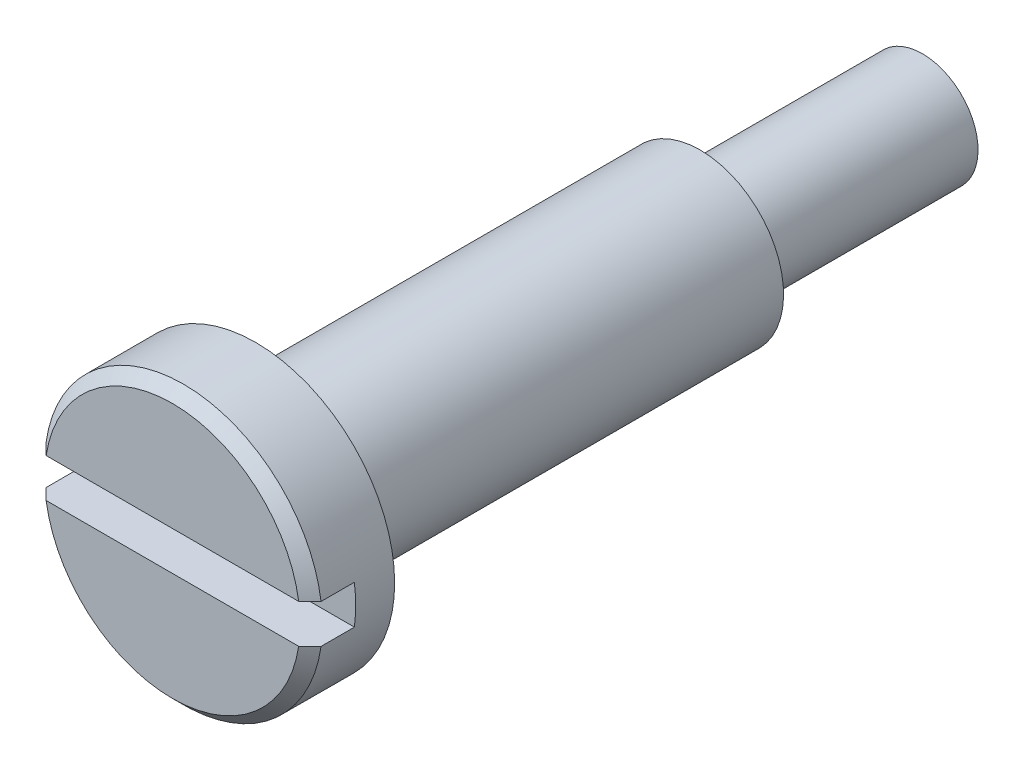
ISO-10303-21;
HEADER;
FILE_DESCRIPTION(('STEP AP214'),'2;1');
FILE_NAME('part.step','',(''),(''),'','','');
FILE_SCHEMA(('AUTOMOTIVE_DESIGN { 1 0 10303 214 1 1 1 1 }'));
ENDSEC;
DATA;
#1=APPLICATION_CONTEXT('core data for automotive mechanical design processes');
#2=APPLICATION_PROTOCOL_DEFINITION('international standard','automotive_design',2000,#1);
#3=PRODUCT_CONTEXT('',#1,'mechanical');
#4=PRODUCT('Part','Part','',(#3));
#5=PRODUCT_RELATED_PRODUCT_CATEGORY('part','',(#4));
#6=PRODUCT_DEFINITION_FORMATION('','',#4);
#7=PRODUCT_DEFINITION_CONTEXT('part definition',#1,'design');
#8=PRODUCT_DEFINITION('design','',#6,#7);
#9=PRODUCT_DEFINITION_SHAPE('','',#8);
#10=(LENGTH_UNIT() NAMED_UNIT(*) SI_UNIT(.MILLI.,.METRE.));
#11=(NAMED_UNIT(*) PLANE_ANGLE_UNIT() SI_UNIT($,.RADIAN.));
#12=(NAMED_UNIT(*) SI_UNIT($,.STERADIAN.) SOLID_ANGLE_UNIT());
#13=UNCERTAINTY_MEASURE_WITH_UNIT(LENGTH_MEASURE(1.E-05),#10,'distance_accuracy_value','');
#14=(GEOMETRIC_REPRESENTATION_CONTEXT(3) GLOBAL_UNCERTAINTY_ASSIGNED_CONTEXT((#13)) GLOBAL_UNIT_ASSIGNED_CONTEXT((#10,
#11,#12)) REPRESENTATION_CONTEXT('',''));
#15=CARTESIAN_POINT('',(0.,0.,0.));
#16=DIRECTION('',(0.,0.,1.));
#17=DIRECTION('',(1.,0.,0.));
#18=AXIS2_PLACEMENT_3D('',#15,#16,#17);
#19=CARTESIAN_POINT('',(0.,0.,0.));
#20=DIRECTION('',(0.,0.,1.));
#21=DIRECTION('',(0.,-1.,0.));
#22=AXIS2_PLACEMENT_3D('',#19,#20,#21);
#23=PLANE('',#22);
#24=DIRECTION('',(1.,0.,0.));
#25=VECTOR('',#24,1.);
#26=CARTESIAN_POINT('',(0.,-0.35,0.));
#27=LINE('',#26,#25);
#28=CARTESIAN_POINT('',(-2.27321358433386,-0.35,0.));
#29=VERTEX_POINT('',#28);
#30=CARTESIAN_POINT('',(2.27321358433386,-0.35,0.));
#31=VERTEX_POINT('',#30);
#32=EDGE_CURVE('E144',#29,#31,#27,.T.);
#33=ORIENTED_EDGE('',*,*,#32,.F.);
#34=CARTESIAN_POINT('',(0.,0.,0.));
#35=DIRECTION('',(0.,0.,1.));
#36=DIRECTION('',(0.,-1.,0.));
#37=AXIS2_PLACEMENT_3D('',#34,#35,#36);
#38=CIRCLE('',#37,2.3);
#39=EDGE_CURVE('E11',#29,#31,#38,.T.);
#40=ORIENTED_EDGE('',*,*,#39,.T.);
#41=EDGE_LOOP('',(#33,#40));
#42=FACE_BOUND('',#41,.T.);
#43=ADVANCED_FACE('F36',(#42),#23,.T.);
#44=DIRECTION('',(-1.,0.,0.));
#45=VECTOR('',#44,1.);
#46=CARTESIAN_POINT('',(0.,0.35,0.));
#47=LINE('',#46,#45);
#48=CARTESIAN_POINT('',(2.27321358433386,0.35,0.));
#49=VERTEX_POINT('',#48);
#50=CARTESIAN_POINT('',(-2.27321358433386,0.35,0.));
#51=VERTEX_POINT('',#50);
#52=EDGE_CURVE('E146',#49,#51,#47,.T.);
#53=ORIENTED_EDGE('',*,*,#52,.F.);
#54=CARTESIAN_POINT('',(0.,0.,0.));
#55=DIRECTION('',(0.,0.,1.));
#56=DIRECTION('',(0.,-1.,0.));
#57=AXIS2_PLACEMENT_3D('',#54,#55,#56);
#58=CIRCLE('',#57,2.3);
#59=EDGE_CURVE('E159',#49,#51,#58,.T.);
#60=ORIENTED_EDGE('',*,*,#59,.T.);
#61=EDGE_LOOP('',(#53,#60));
#62=FACE_BOUND('',#61,.T.);
#63=ADVANCED_FACE('F162',(#62),#23,.T.);
#64=CARTESIAN_POINT('',(0.,0.,-13.5));
#65=DIRECTION('',(0.,0.,-1.));
#66=DIRECTION('',(0.,1.,0.));
#67=AXIS2_PLACEMENT_3D('',#64,#65,#66);
#68=CYLINDRICAL_SURFACE('',#67,2.5);
#69=DIRECTION('',(0.,0.,-1.));
#70=VECTOR('',#69,1.);
#71=CARTESIAN_POINT('',(-2.47537875889732,0.350000000000002,-13.5));
#72=LINE('',#71,#70);
#73=CARTESIAN_POINT('',(-2.47537875889732,0.35,-0.200000000000004));
#74=VERTEX_POINT('',#73);
#75=CARTESIAN_POINT('',(-2.47537875889732,0.35,-0.8));
#76=VERTEX_POINT('',#75);
#77=EDGE_CURVE('E88',#74,#76,#72,.T.);
#78=ORIENTED_EDGE('',*,*,#77,.F.);
#79=CARTESIAN_POINT('',(0.,0.,-0.200000000000004));
#80=DIRECTION('',(0.,0.,1.));
#81=DIRECTION('',(0.,-1.,0.));
#82=AXIS2_PLACEMENT_3D('',#79,#80,#81);
#83=CIRCLE('',#82,2.5);
#84=CARTESIAN_POINT('',(2.47537875889732,0.35,-0.200000000000004));
#85=VERTEX_POINT('',#84);
#86=EDGE_CURVE('E154',#74,#85,#83,.F.);
#87=ORIENTED_EDGE('',*,*,#86,.T.);
#88=DIRECTION('',(0.,0.,-1.));
#89=VECTOR('',#88,1.);
#90=CARTESIAN_POINT('',(2.47537875889732,0.350000000000002,-13.5));
#91=LINE('',#90,#89);
#92=CARTESIAN_POINT('',(2.47537875889732,0.35,-0.8));
#93=VERTEX_POINT('',#92);
#94=EDGE_CURVE('E117',#93,#85,#91,.F.);
#95=ORIENTED_EDGE('',*,*,#94,.F.);
#96=CARTESIAN_POINT('',(0.,0.,-0.8));
#97=DIRECTION('',(0.,0.,-1.));
#98=DIRECTION('',(-1.,0.,0.));
#99=AXIS2_PLACEMENT_3D('',#96,#97,#98);
#100=CIRCLE('',#99,2.5);
#101=CARTESIAN_POINT('',(2.47537875889731,-0.35,-0.8));
#102=VERTEX_POINT('',#101);
#103=EDGE_CURVE('E109',#102,#93,#100,.F.);
#104=ORIENTED_EDGE('',*,*,#103,.F.);
#105=DIRECTION('',(0.,0.,-1.));
#106=VECTOR('',#105,1.);
#107=CARTESIAN_POINT('',(2.47537875889731,-0.350000000000002,-13.5));
#108=LINE('',#107,#106);
#109=CARTESIAN_POINT('',(2.47537875889731,-0.350000000000003,-0.199999999999999));
#110=VERTEX_POINT('',#109);
#111=EDGE_CURVE('E101',#110,#102,#108,.T.);
#112=ORIENTED_EDGE('',*,*,#111,.F.);
#113=CARTESIAN_POINT('',(0.,0.,-0.199999999999999));
#114=DIRECTION('',(0.,0.,1.));
#115=DIRECTION('',(0.,-1.,0.));
#116=AXIS2_PLACEMENT_3D('',#113,#114,#115);
#117=CIRCLE('',#116,2.5);
#118=CARTESIAN_POINT('',(-2.47537875889731,-0.350000000000003,-0.199999999999999));
#119=VERTEX_POINT('',#118);
#120=EDGE_CURVE('E238',#110,#119,#117,.F.);
#121=ORIENTED_EDGE('',*,*,#120,.T.);
#122=DIRECTION('',(0.,0.,-1.));
#123=VECTOR('',#122,1.);
#124=CARTESIAN_POINT('',(-2.47537875889731,-0.350000000000002,-13.5));
#125=LINE('',#124,#123);
#126=CARTESIAN_POINT('',(-2.47537875889731,-0.35,-0.8));
#127=VERTEX_POINT('',#126);
#128=EDGE_CURVE('E116',#127,#119,#125,.F.);
#129=ORIENTED_EDGE('',*,*,#128,.F.);
#130=EDGE_CURVE('E102',#76,#127,#100,.F.);
#131=ORIENTED_EDGE('',*,*,#130,.F.);
#132=EDGE_LOOP('',(#78,#87,#95,#104,#112,#121,#129,#131));
#133=FACE_BOUND('',#132,.T.);
#134=CARTESIAN_POINT('',(0.,0.,-1.5));
#135=DIRECTION('',(0.,0.,-1.));
#136=DIRECTION('',(0.,1.,0.));
#137=AXIS2_PLACEMENT_3D('',#134,#135,#136);
#138=CIRCLE('',#137,2.5);
#139=CARTESIAN_POINT('',(0.,2.5,-1.5));
#140=VERTEX_POINT('',#139);
#141=EDGE_CURVE('E121',#140,#140,#138,.T.);
#142=ORIENTED_EDGE('',*,*,#141,.F.);
#143=EDGE_LOOP('',(#142));
#144=FACE_BOUND('',#143,.T.);
#145=ADVANCED_FACE('F113',(#133,#144),#68,.T.);
#146=CARTESIAN_POINT('',(0.,2.5,-1.5));
#147=DIRECTION('',(0.,0.,-1.));
#148=DIRECTION('',(0.,1.,0.));
#149=AXIS2_PLACEMENT_3D('',#146,#147,#148);
#150=PLANE('',#149);
#151=ORIENTED_EDGE('',*,*,#141,.T.);
#152=EDGE_LOOP('',(#151));
#153=FACE_BOUND('',#152,.T.);
#154=CARTESIAN_POINT('',(0.,0.,-1.5));
#155=DIRECTION('',(0.,0.,-1.));
#156=DIRECTION('',(0.,1.,0.));
#157=AXIS2_PLACEMENT_3D('',#154,#155,#156);
#158=CIRCLE('',#157,1.5);
#159=CARTESIAN_POINT('',(0.,1.5,-1.5));
#160=VERTEX_POINT('',#159);
#161=EDGE_CURVE('E123',#160,#160,#158,.T.);
#162=ORIENTED_EDGE('',*,*,#161,.F.);
#163=EDGE_LOOP('',(#162));
#164=FACE_BOUND('',#163,.T.);
#165=ADVANCED_FACE('F206',(#153,#164),#150,.T.);
#166=CARTESIAN_POINT('',(0.,0.,-13.5));
#167=DIRECTION('',(0.,0.,-1.));
#168=DIRECTION('',(0.,1.,0.));
#169=AXIS2_PLACEMENT_3D('',#166,#167,#168);
#170=CYLINDRICAL_SURFACE('',#169,1.5);
#171=ORIENTED_EDGE('',*,*,#161,.T.);
#172=EDGE_LOOP('',(#171));
#173=FACE_BOUND('',#172,.T.);
#174=CARTESIAN_POINT('',(0.,0.,-9.5));
#175=DIRECTION('',(0.,0.,-1.));
#176=DIRECTION('',(0.,1.,0.));
#177=AXIS2_PLACEMENT_3D('',#174,#175,#176);
#178=CIRCLE('',#177,1.5);
#179=CARTESIAN_POINT('',(0.,1.5,-9.5));
#180=VERTEX_POINT('',#179);
#181=EDGE_CURVE('E127',#180,#180,#178,.T.);
#182=ORIENTED_EDGE('',*,*,#181,.F.);
#183=EDGE_LOOP('',(#182));
#184=FACE_BOUND('',#183,.T.);
#185=ADVANCED_FACE('F209',(#173,#184),#170,.T.);
#186=CARTESIAN_POINT('',(0.,1.5,-9.5));
#187=DIRECTION('',(0.,0.,-1.));
#188=DIRECTION('',(0.,1.,0.));
#189=AXIS2_PLACEMENT_3D('',#186,#187,#188);
#190=PLANE('',#189);
#191=ORIENTED_EDGE('',*,*,#181,.T.);
#192=EDGE_LOOP('',(#191));
#193=FACE_BOUND('',#192,.T.);
#194=CARTESIAN_POINT('',(0.,0.,-9.5));
#195=DIRECTION('',(0.,0.,-1.));
#196=DIRECTION('',(0.,1.,0.));
#197=AXIS2_PLACEMENT_3D('',#194,#195,#196);
#198=CIRCLE('',#197,0.700000000000002);
#199=CARTESIAN_POINT('',(0.,0.700000000000003,-9.5));
#200=VERTEX_POINT('',#199);
#201=EDGE_CURVE('E132',#200,#200,#198,.T.);
#202=ORIENTED_EDGE('',*,*,#201,.F.);
#203=EDGE_LOOP('',(#202));
#204=FACE_BOUND('',#203,.T.);
#205=ADVANCED_FACE('F212',(#193,#204),#190,.T.);
#206=CARTESIAN_POINT('',(0.,0.,-13.5));
#207=DIRECTION('',(0.,0.,-1.));
#208=DIRECTION('',(0.,1.,0.));
#209=AXIS2_PLACEMENT_3D('',#206,#207,#208);
#210=CYLINDRICAL_SURFACE('',#209,0.700000000000002);
#211=ORIENTED_EDGE('',*,*,#201,.T.);
#212=EDGE_LOOP('',(#211));
#213=FACE_BOUND('',#212,.T.);
#214=CARTESIAN_POINT('',(0.,0.,-9.8));
#215=DIRECTION('',(0.,0.,-1.));
#216=DIRECTION('',(0.,1.,0.));
#217=AXIS2_PLACEMENT_3D('',#214,#215,#216);
#218=CIRCLE('',#217,0.700000000000002);
#219=CARTESIAN_POINT('',(0.,0.700000000000003,-9.8));
#220=VERTEX_POINT('',#219);
#221=EDGE_CURVE('E135',#220,#220,#218,.T.);
#222=ORIENTED_EDGE('',*,*,#221,.F.);
#223=EDGE_LOOP('',(#222));
#224=FACE_BOUND('',#223,.T.);
#225=ADVANCED_FACE('F216',(#213,#224),#210,.T.);
#226=CARTESIAN_POINT('',(0.,0.700000000000003,-9.8));
#227=DIRECTION('',(0.,0.,1.));
#228=DIRECTION('',(0.,-1.,0.));
#229=AXIS2_PLACEMENT_3D('',#226,#227,#228);
#230=PLANE('',#229);
#231=ORIENTED_EDGE('',*,*,#221,.T.);
#232=EDGE_LOOP('',(#231));
#233=FACE_BOUND('',#232,.T.);
#234=CARTESIAN_POINT('',(0.,0.,-9.8));
#235=DIRECTION('',(0.,0.,-1.));
#236=DIRECTION('',(0.,1.,0.));
#237=AXIS2_PLACEMENT_3D('',#234,#235,#236);
#238=CIRCLE('',#237,1.);
#239=CARTESIAN_POINT('',(0.,1.,-9.8));
#240=VERTEX_POINT('',#239);
#241=EDGE_CURVE('E138',#240,#240,#238,.T.);
#242=ORIENTED_EDGE('',*,*,#241,.F.);
#243=EDGE_LOOP('',(#242));
#244=FACE_BOUND('',#243,.T.);
#245=ADVANCED_FACE('F220',(#233,#244),#230,.T.);
#246=CARTESIAN_POINT('',(0.,0.,-13.5));
#247=DIRECTION('',(0.,0.,-1.));
#248=DIRECTION('',(0.,1.,0.));
#249=AXIS2_PLACEMENT_3D('',#246,#247,#248);
#250=CYLINDRICAL_SURFACE('',#249,1.);
#251=ORIENTED_EDGE('',*,*,#241,.T.);
#252=EDGE_LOOP('',(#251));
#253=FACE_BOUND('',#252,.T.);
#254=CARTESIAN_POINT('',(0.,0.,-13.5));
#255=DIRECTION('',(0.,0.,-1.));
#256=DIRECTION('',(0.,1.,0.));
#257=AXIS2_PLACEMENT_3D('',#254,#255,#256);
#258=CIRCLE('',#257,1.);
#259=CARTESIAN_POINT('',(0.,1.,-13.5));
#260=VERTEX_POINT('',#259);
#261=EDGE_CURVE('E141',#260,#260,#258,.T.);
#262=ORIENTED_EDGE('',*,*,#261,.F.);
#263=EDGE_LOOP('',(#262));
#264=FACE_BOUND('',#263,.T.);
#265=ADVANCED_FACE('F224',(#253,#264),#250,.T.);
#266=CARTESIAN_POINT('',(0.,1.,-13.5));
#267=DIRECTION('',(0.,0.,-1.));
#268=DIRECTION('',(0.,1.,0.));
#269=AXIS2_PLACEMENT_3D('',#266,#267,#268);
#270=PLANE('',#269);
#271=ORIENTED_EDGE('',*,*,#261,.T.);
#272=EDGE_LOOP('',(#271));
#273=FACE_BOUND('',#272,.T.);
#274=ADVANCED_FACE('F227',(#273),#270,.T.);
#275=CARTESIAN_POINT('',(-2.5,-0.35,-0.8));
#276=DIRECTION('',(0.,0.,-1.));
#277=DIRECTION('',(-1.,0.,0.));
#278=AXIS2_PLACEMENT_3D('',#275,#276,#277);
#279=PLANE('',#278);
#280=DIRECTION('',(1.,0.,0.));
#281=VECTOR('',#280,1.);
#282=CARTESIAN_POINT('',(-2.5,-0.35,-0.8));
#283=LINE('',#282,#281);
#284=EDGE_CURVE('E110',#127,#102,#283,.T.);
#285=ORIENTED_EDGE('',*,*,#284,.T.);
#286=ORIENTED_EDGE('',*,*,#103,.T.);
#287=DIRECTION('',(1.,0.,0.));
#288=VECTOR('',#287,1.);
#289=CARTESIAN_POINT('',(-2.5,0.35,-0.8));
#290=LINE('',#289,#288);
#291=EDGE_CURVE('E92',#76,#93,#290,.T.);
#292=ORIENTED_EDGE('',*,*,#291,.F.);
#293=ORIENTED_EDGE('',*,*,#130,.T.);
#294=EDGE_LOOP('',(#285,#286,#292,#293));
#295=FACE_BOUND('',#294,.T.);
#296=ADVANCED_FACE('F106',(#295),#279,.F.);
#297=CARTESIAN_POINT('',(-2.5,-0.35,0.8));
#298=DIRECTION('',(0.,-1.,0.));
#299=DIRECTION('',(0.,0.,-1.));
#300=AXIS2_PLACEMENT_3D('',#297,#298,#299);
#301=PLANE('',#300);
#302=ORIENTED_EDGE('',*,*,#128,.T.);
#303=CARTESIAN_POINT('',(-2.47537875889731,-0.350000000000003,-0.199999999999999));
#304=CARTESIAN_POINT('',(-2.44169967965712,-0.350000000000002,-0.166651386641134));
#305=CARTESIAN_POINT('',(-2.40801304219284,-0.35,-0.133310413330724));
#306=CARTESIAN_POINT('',(-2.34062465067175,-0.349999999999999,-0.0666437466639924));
#307=CARTESIAN_POINT('',(-2.30692289661488,-0.349999999999999,-0.0333180533077363));
#308=CARTESIAN_POINT('',(-2.27321358433386,-0.35,0.));
#309=B_SPLINE_CURVE_WITH_KNOTS('',3,(#303,#304,#305,#306,#307,#308),.UNSPECIFIED.,.F.,.F.,(4,2,
4),(0.,0.142188925041359,0.284377850691939),.UNSPECIFIED.);
#310=EDGE_CURVE('E46',#119,#29,#309,.T.);
#311=ORIENTED_EDGE('',*,*,#310,.T.);
#312=ORIENTED_EDGE('',*,*,#32,.T.);
#313=CARTESIAN_POINT('',(2.27321358433386,-0.35,0.));
#314=CARTESIAN_POINT('',(2.30692289661488,-0.35,-0.0333180533077362));
#315=CARTESIAN_POINT('',(2.34062465067175,-0.35,-0.0666437466639924));
#316=CARTESIAN_POINT('',(2.40801304219284,-0.35,-0.133310413330724));
#317=CARTESIAN_POINT('',(2.44169967965712,-0.35,-0.166651386641134));
#318=CARTESIAN_POINT('',(2.47537875889731,-0.35,-0.199999999999998));
#319=B_SPLINE_CURVE_WITH_KNOTS('',3,(#313,#314,#315,#316,#317,#318),.UNSPECIFIED.,.F.,.F.,(4,2,
4),(0.,0.14218892565058,0.284377850691939),.UNSPECIFIED.);
#320=EDGE_CURVE('E151',#31,#110,#319,.T.);
#321=ORIENTED_EDGE('',*,*,#320,.T.);
#322=ORIENTED_EDGE('',*,*,#111,.T.);
#323=ORIENTED_EDGE('',*,*,#284,.F.);
#324=EDGE_LOOP('',(#302,#311,#312,#321,#322,#323));
#325=FACE_BOUND('',#324,.T.);
#326=ADVANCED_FACE('F148',(#325),#301,.F.);
#327=CARTESIAN_POINT('',(-2.5,0.35,0.8));
#328=DIRECTION('',(0.,1.,0.));
#329=DIRECTION('',(0.,0.,1.));
#330=AXIS2_PLACEMENT_3D('',#327,#328,#329);
#331=PLANE('',#330);
#332=ORIENTED_EDGE('',*,*,#94,.T.);
#333=CARTESIAN_POINT('',(2.47537875889732,0.35,-0.200000000000004));
#334=CARTESIAN_POINT('',(2.44169967965712,0.35,-0.166651386641139));
#335=CARTESIAN_POINT('',(2.40801304219284,0.35,-0.133310413330728));
#336=CARTESIAN_POINT('',(2.34062465067175,0.35,-0.0666437466639942));
#337=CARTESIAN_POINT('',(2.30692289661488,0.35,-0.0333180533077371));
#338=CARTESIAN_POINT('',(2.27321358433386,0.35,0.));
#339=B_SPLINE_CURVE_WITH_KNOTS('',3,(#333,#334,#335,#336,#337,#338),.UNSPECIFIED.,.F.,.F.,(4,2,
4),(0.,0.142188925041361,0.284377850691944),.UNSPECIFIED.);
#340=EDGE_CURVE('E155',#85,#49,#339,.T.);
#341=ORIENTED_EDGE('',*,*,#340,.T.);
#342=ORIENTED_EDGE('',*,*,#52,.T.);
#343=CARTESIAN_POINT('',(-2.27321358433386,0.35,0.));
#344=CARTESIAN_POINT('',(-2.30692289661488,0.35,-0.0333180533077371));
#345=CARTESIAN_POINT('',(-2.34062465067175,0.35,-0.0666437466639942));
#346=CARTESIAN_POINT('',(-2.40801304219284,0.35,-0.133310413330728));
#347=CARTESIAN_POINT('',(-2.44169967965712,0.35,-0.166651386641139));
#348=CARTESIAN_POINT('',(-2.47537875889732,0.35,-0.200000000000004));
#349=B_SPLINE_CURVE_WITH_KNOTS('',3,(#343,#344,#345,#346,#347,#348),.UNSPECIFIED.,.F.,.F.,(4,2,
4),(0.,0.142188925650582,0.284377850691944),.UNSPECIFIED.);
#350=EDGE_CURVE('E96',#51,#74,#349,.T.);
#351=ORIENTED_EDGE('',*,*,#350,.T.);
#352=ORIENTED_EDGE('',*,*,#77,.T.);
#353=ORIENTED_EDGE('',*,*,#291,.T.);
#354=EDGE_LOOP('',(#332,#341,#342,#351,#352,#353));
#355=FACE_BOUND('',#354,.T.);
#356=ADVANCED_FACE('F91',(#355),#331,.F.);
#357=CARTESIAN_POINT('',(0.,0.,-0.200000000000004));
#358=DIRECTION('',(0.,0.,-1.));
#359=DIRECTION('',(0.,1.,0.));
#360=AXIS2_PLACEMENT_3D('',#357,#358,#359);
#361=CONICAL_SURFACE('',#360,2.5,0.785398163397445);
#362=ORIENTED_EDGE('',*,*,#350,.F.);
#363=ORIENTED_EDGE('',*,*,#59,.F.);
#364=ORIENTED_EDGE('',*,*,#340,.F.);
#365=ORIENTED_EDGE('',*,*,#86,.F.);
#366=EDGE_LOOP('',(#362,#363,#364,#365));
#367=FACE_BOUND('',#366,.T.);
#368=ADVANCED_FACE('F163',(#367),#361,.T.);
#369=CARTESIAN_POINT('',(0.,0.,-0.199999999999999));
#370=DIRECTION('',(0.,0.,-1.));
#371=DIRECTION('',(0.,1.,0.));
#372=AXIS2_PLACEMENT_3D('',#369,#370,#371);
#373=CONICAL_SURFACE('',#372,2.5,0.785398163397456);
#374=ORIENTED_EDGE('',*,*,#320,.F.);
#375=ORIENTED_EDGE('',*,*,#39,.F.);
#376=ORIENTED_EDGE('',*,*,#310,.F.);
#377=ORIENTED_EDGE('',*,*,#120,.F.);
#378=EDGE_LOOP('',(#374,#375,#376,#377));
#379=FACE_BOUND('',#378,.T.);
#380=ADVANCED_FACE('F39',(#379),#373,.T.);
#381=CLOSED_SHELL('',(#43,#63,#145,#165,#185,#205,#225,#245,#265,#274,#296,#326,#356,#368,#380));
#382=MANIFOLD_SOLID_BREP('B2',#381);
#383=ADVANCED_BREP_SHAPE_REPRESENTATION('',(#18,#382),#14);
#384=SHAPE_DEFINITION_REPRESENTATION(#9,#383);
ENDSEC;
END-ISO-10303-21;
